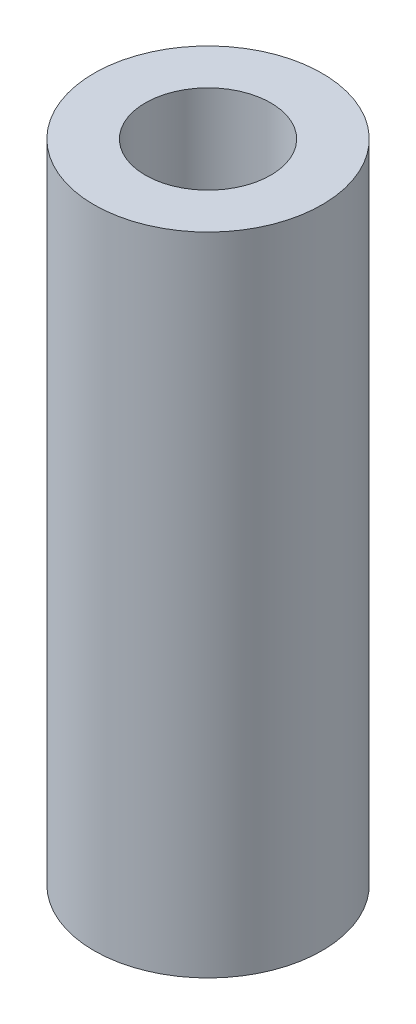
ISO-10303-21;
HEADER;
FILE_DESCRIPTION(('STEP AP214'),'2;1');
FILE_NAME('part.step','',(''),(''),'','','');
FILE_SCHEMA(('AUTOMOTIVE_DESIGN { 1 0 10303 214 1 1 1 1 }'));
ENDSEC;
DATA;
#1=APPLICATION_CONTEXT('core data for automotive mechanical design processes');
#2=APPLICATION_PROTOCOL_DEFINITION('international standard','automotive_design',2000,#1);
#3=PRODUCT_CONTEXT('',#1,'mechanical');
#4=PRODUCT('Part','Part','',(#3));
#5=PRODUCT_RELATED_PRODUCT_CATEGORY('part','',(#4));
#6=PRODUCT_DEFINITION_FORMATION('','',#4);
#7=PRODUCT_DEFINITION_CONTEXT('part definition',#1,'design');
#8=PRODUCT_DEFINITION('design','',#6,#7);
#9=PRODUCT_DEFINITION_SHAPE('','',#8);
#10=(LENGTH_UNIT() NAMED_UNIT(*) SI_UNIT(.MILLI.,.METRE.));
#11=(NAMED_UNIT(*) PLANE_ANGLE_UNIT() SI_UNIT($,.RADIAN.));
#12=(NAMED_UNIT(*) SI_UNIT($,.STERADIAN.) SOLID_ANGLE_UNIT());
#13=UNCERTAINTY_MEASURE_WITH_UNIT(LENGTH_MEASURE(1.E-05),#10,'distance_accuracy_value','');
#14=(GEOMETRIC_REPRESENTATION_CONTEXT(3) GLOBAL_UNCERTAINTY_ASSIGNED_CONTEXT((#13)) GLOBAL_UNIT_ASSIGNED_CONTEXT((#10,
#11,#12)) REPRESENTATION_CONTEXT('',''));
#15=CARTESIAN_POINT('',(0.,0.,0.));
#16=DIRECTION('',(0.,0.,1.));
#17=DIRECTION('',(1.,0.,0.));
#18=AXIS2_PLACEMENT_3D('',#15,#16,#17);
#19=CARTESIAN_POINT('',(5.03686211808113,160.565722281243,260.757908840686));
#20=DIRECTION('',(0.,1.,0.));
#21=DIRECTION('',(0.,0.,1.));
#22=AXIS2_PLACEMENT_3D('',#19,#20,#21);
#23=PLANE('',#22);
#24=CARTESIAN_POINT('',(5.03686211808113,160.565722281243,260.757908840686));
#25=DIRECTION('',(0.,1.,0.));
#26=DIRECTION('',(0.,0.,1.));
#27=AXIS2_PLACEMENT_3D('',#24,#25,#26);
#28=CIRCLE('',#27,3.);
#29=CARTESIAN_POINT('',(5.03686211808113,160.565722281243,263.757908840686));
#30=VERTEX_POINT('',#29);
#31=EDGE_CURVE('E10',#30,#30,#28,.T.);
#32=ORIENTED_EDGE('',*,*,#31,.T.);
#33=EDGE_LOOP('',(#32));
#34=FACE_BOUND('',#33,.T.);
#35=CARTESIAN_POINT('',(5.03686211808106,160.565722281243,260.757908840686));
#36=DIRECTION('',(0.,1.,0.));
#37=DIRECTION('',(0.,0.,1.));
#38=AXIS2_PLACEMENT_3D('',#35,#36,#37);
#39=CIRCLE('',#38,1.64999999999999);
#40=CARTESIAN_POINT('',(5.03686211808106,160.565722281243,262.407908840685));
#41=VERTEX_POINT('',#40);
#42=EDGE_CURVE('E41',#41,#41,#39,.T.);
#43=ORIENTED_EDGE('',*,*,#42,.F.);
#44=EDGE_LOOP('',(#43));
#45=FACE_BOUND('',#44,.T.);
#46=ADVANCED_FACE('F30',(#34,#45),#23,.T.);
#47=CARTESIAN_POINT('',(5.03686211808113,143.565722281243,260.757908840686));
#48=DIRECTION('',(0.,1.,0.));
#49=DIRECTION('',(0.,0.,1.));
#50=AXIS2_PLACEMENT_3D('',#47,#48,#49);
#51=PLANE('',#50);
#52=CARTESIAN_POINT('',(5.03686211808113,143.565722281243,260.757908840686));
#53=DIRECTION('',(0.,1.,0.));
#54=DIRECTION('',(0.,0.,1.));
#55=AXIS2_PLACEMENT_3D('',#52,#53,#54);
#56=CIRCLE('',#55,3.);
#57=CARTESIAN_POINT('',(5.03686211808113,143.565722281243,263.757908840686));
#58=VERTEX_POINT('',#57);
#59=EDGE_CURVE('E34',#58,#58,#56,.T.);
#60=ORIENTED_EDGE('',*,*,#59,.F.);
#61=EDGE_LOOP('',(#60));
#62=FACE_BOUND('',#61,.T.);
#63=CARTESIAN_POINT('',(5.03686211808106,143.565722281243,260.757908840686));
#64=DIRECTION('',(0.,1.,0.));
#65=DIRECTION('',(0.,0.,1.));
#66=AXIS2_PLACEMENT_3D('',#63,#64,#65);
#67=CIRCLE('',#66,1.64999999999999);
#68=CARTESIAN_POINT('',(5.03686211808106,143.565722281243,262.407908840685));
#69=VERTEX_POINT('',#68);
#70=EDGE_CURVE('E43',#69,#69,#67,.T.);
#71=ORIENTED_EDGE('',*,*,#70,.T.);
#72=EDGE_LOOP('',(#71));
#73=FACE_BOUND('',#72,.T.);
#74=ADVANCED_FACE('F53',(#62,#73),#51,.F.);
#75=CARTESIAN_POINT('',(5.03686211808113,160.565722281243,260.757908840686));
#76=DIRECTION('',(0.,-1.,0.));
#77=DIRECTION('',(0.,0.,-1.));
#78=AXIS2_PLACEMENT_3D('',#75,#76,#77);
#79=CYLINDRICAL_SURFACE('',#78,3.);
#80=ORIENTED_EDGE('',*,*,#31,.F.);
#81=EDGE_LOOP('',(#80));
#82=FACE_BOUND('',#81,.T.);
#83=ORIENTED_EDGE('',*,*,#59,.T.);
#84=EDGE_LOOP('',(#83));
#85=FACE_BOUND('',#84,.T.);
#86=ADVANCED_FACE('F32',(#82,#85),#79,.T.);
#87=CARTESIAN_POINT('',(5.03686211808106,160.565722281243,260.757908840686));
#88=DIRECTION('',(0.,-1.,0.));
#89=DIRECTION('',(0.,0.,-1.));
#90=AXIS2_PLACEMENT_3D('',#87,#88,#89);
#91=CYLINDRICAL_SURFACE('',#90,1.64999999999999);
#92=ORIENTED_EDGE('',*,*,#42,.T.);
#93=EDGE_LOOP('',(#92));
#94=FACE_BOUND('',#93,.T.);
#95=ORIENTED_EDGE('',*,*,#70,.F.);
#96=EDGE_LOOP('',(#95));
#97=FACE_BOUND('',#96,.T.);
#98=ADVANCED_FACE('F49',(#94,#97),#91,.F.);
#99=CLOSED_SHELL('',(#46,#74,#86,#98));
#100=MANIFOLD_SOLID_BREP('B2',#99);
#101=ADVANCED_BREP_SHAPE_REPRESENTATION('',(#18,#100),#14);
#102=SHAPE_DEFINITION_REPRESENTATION(#9,#101);
ENDSEC;
END-ISO-10303-21;
